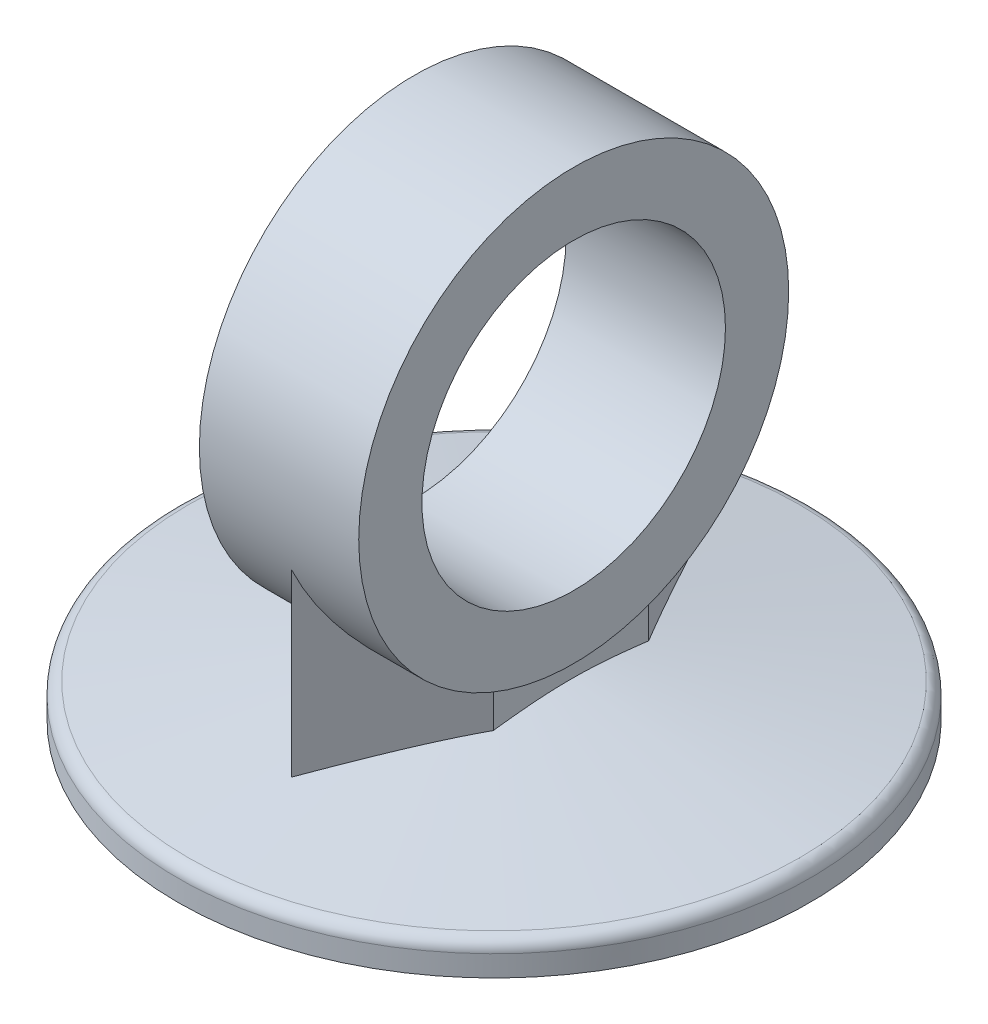
ISO-10303-21;
HEADER;
FILE_DESCRIPTION(('STEP AP214'),'2;1');
FILE_NAME('part.step','',(''),(''),'','','');
FILE_SCHEMA(('AUTOMOTIVE_DESIGN { 1 0 10303 214 1 1 1 1 }'));
ENDSEC;
DATA;
#1=APPLICATION_CONTEXT('core data for automotive mechanical design processes');
#2=APPLICATION_PROTOCOL_DEFINITION('international standard','automotive_design',2000,#1);
#3=PRODUCT_CONTEXT('',#1,'mechanical');
#4=PRODUCT('Part','Part','',(#3));
#5=PRODUCT_RELATED_PRODUCT_CATEGORY('part','',(#4));
#6=PRODUCT_DEFINITION_FORMATION('','',#4);
#7=PRODUCT_DEFINITION_CONTEXT('part definition',#1,'design');
#8=PRODUCT_DEFINITION('design','',#6,#7);
#9=PRODUCT_DEFINITION_SHAPE('','',#8);
#10=(LENGTH_UNIT() NAMED_UNIT(*) SI_UNIT(.MILLI.,.METRE.));
#11=(NAMED_UNIT(*) PLANE_ANGLE_UNIT() SI_UNIT($,.RADIAN.));
#12=(NAMED_UNIT(*) SI_UNIT($,.STERADIAN.) SOLID_ANGLE_UNIT());
#13=UNCERTAINTY_MEASURE_WITH_UNIT(LENGTH_MEASURE(1.E-05),#10,'distance_accuracy_value','');
#14=(GEOMETRIC_REPRESENTATION_CONTEXT(3) GLOBAL_UNCERTAINTY_ASSIGNED_CONTEXT((#13)) GLOBAL_UNIT_ASSIGNED_CONTEXT((#10,
#11,#12)) REPRESENTATION_CONTEXT('',''));
#15=CARTESIAN_POINT('',(0.,0.,0.));
#16=DIRECTION('',(0.,0.,1.));
#17=DIRECTION('',(1.,0.,0.));
#18=AXIS2_PLACEMENT_3D('',#15,#16,#17);
#19=CARTESIAN_POINT('',(-6.3,24.,0.));
#20=DIRECTION('',(1.,0.,0.));
#21=DIRECTION('',(0.,0.,-1.));
#22=AXIS2_PLACEMENT_3D('',#19,#20,#21);
#23=PLANE('',#22);
#24=CARTESIAN_POINT('',(-6.3,24.,0.));
#25=DIRECTION('',(1.,0.,0.));
#26=DIRECTION('',(0.,0.,-1.));
#27=AXIS2_PLACEMENT_3D('',#24,#25,#26);
#28=CIRCLE('',#27,17.);
#29=CARTESIAN_POINT('',(-6.3,24.,-17.));
#30=VERTEX_POINT('',#29);
#31=EDGE_CURVE('E119',#30,#30,#28,.T.);
#32=ORIENTED_EDGE('',*,*,#31,.F.);
#33=EDGE_LOOP('',(#32));
#34=FACE_BOUND('',#33,.T.);
#35=CARTESIAN_POINT('',(-6.3,24.,0.));
#36=DIRECTION('',(1.,0.,0.));
#37=DIRECTION('',(0.,0.,-1.));
#38=AXIS2_PLACEMENT_3D('',#35,#36,#37);
#39=CIRCLE('',#38,12.);
#40=CARTESIAN_POINT('',(-6.3,24.,-12.));
#41=VERTEX_POINT('',#40);
#42=EDGE_CURVE('E231',#41,#41,#39,.T.);
#43=ORIENTED_EDGE('',*,*,#42,.T.);
#44=EDGE_LOOP('',(#43));
#45=FACE_BOUND('',#44,.T.);
#46=ADVANCED_FACE('F41',(#34,#45),#23,.F.);
#47=CARTESIAN_POINT('',(6.3,24.,0.));
#48=DIRECTION('',(1.,0.,0.));
#49=DIRECTION('',(0.,0.,-1.));
#50=AXIS2_PLACEMENT_3D('',#47,#48,#49);
#51=PLANE('',#50);
#52=CARTESIAN_POINT('',(6.3,24.,0.));
#53=DIRECTION('',(1.,0.,0.));
#54=DIRECTION('',(0.,0.,-1.));
#55=AXIS2_PLACEMENT_3D('',#52,#53,#54);
#56=CIRCLE('',#55,17.);
#57=CARTESIAN_POINT('',(6.3,24.,-17.));
#58=VERTEX_POINT('',#57);
#59=EDGE_CURVE('E123',#58,#58,#56,.T.);
#60=ORIENTED_EDGE('',*,*,#59,.T.);
#61=EDGE_LOOP('',(#60));
#62=FACE_BOUND('',#61,.T.);
#63=CARTESIAN_POINT('',(6.3,24.,0.));
#64=DIRECTION('',(1.,0.,0.));
#65=DIRECTION('',(0.,0.,-1.));
#66=AXIS2_PLACEMENT_3D('',#63,#64,#65);
#67=CIRCLE('',#66,12.);
#68=CARTESIAN_POINT('',(6.3,24.,-12.));
#69=VERTEX_POINT('',#68);
#70=EDGE_CURVE('E228',#69,#69,#67,.T.);
#71=ORIENTED_EDGE('',*,*,#70,.F.);
#72=EDGE_LOOP('',(#71));
#73=FACE_BOUND('',#72,.T.);
#74=ADVANCED_FACE('F208',(#62,#73),#51,.T.);
#75=CARTESIAN_POINT('',(0.,2.5,0.));
#76=DIRECTION('',(0.,-1.,0.));
#77=DIRECTION('',(0.,0.,-1.));
#78=AXIS2_PLACEMENT_3D('',#75,#76,#77);
#79=CYLINDRICAL_SURFACE('',#78,25.);
#80=CARTESIAN_POINT('',(0.,1.66090036882272,0.));
#81=DIRECTION('',(0.,-1.,0.));
#82=DIRECTION('',(0.,0.,-1.));
#83=AXIS2_PLACEMENT_3D('',#80,#81,#82);
#84=CIRCLE('',#83,25.);
#85=CARTESIAN_POINT('',(0.,1.66090036882272,-25.));
#86=VERTEX_POINT('',#85);
#87=EDGE_CURVE('E143',#86,#86,#84,.T.);
#88=ORIENTED_EDGE('',*,*,#87,.T.);
#89=EDGE_LOOP('',(#88));
#90=FACE_BOUND('',#89,.T.);
#91=CARTESIAN_POINT('',(0.,0.,0.));
#92=DIRECTION('',(0.,1.,0.));
#93=DIRECTION('',(0.,0.,1.));
#94=AXIS2_PLACEMENT_3D('',#91,#92,#93);
#95=CIRCLE('',#94,25.);
#96=CARTESIAN_POINT('',(0.,0.,25.));
#97=VERTEX_POINT('',#96);
#98=EDGE_CURVE('E137',#97,#97,#95,.T.);
#99=ORIENTED_EDGE('',*,*,#98,.T.);
#100=EDGE_LOOP('',(#99));
#101=FACE_BOUND('',#100,.T.);
#102=ADVANCED_FACE('F213',(#90,#101),#79,.T.);
#103=CARTESIAN_POINT('',(0.,0.,0.));
#104=DIRECTION('',(0.,1.,0.));
#105=DIRECTION('',(0.,0.,1.));
#106=AXIS2_PLACEMENT_3D('',#103,#104,#105);
#107=PLANE('',#106);
#108=ORIENTED_EDGE('',*,*,#98,.F.);
#109=EDGE_LOOP('',(#108));
#110=FACE_BOUND('',#109,.T.);
#111=ADVANCED_FACE('F275',(#110),#107,.F.);
#112=CARTESIAN_POINT('',(0.,2.5,0.));
#113=DIRECTION('',(0.,-1.,0.));
#114=DIRECTION('',(0.,0.,1.));
#115=AXIS2_PLACEMENT_3D('',#112,#113,#114);
#116=CONICAL_SURFACE('',#115,25.,1.39626340159547);
#117=CARTESIAN_POINT('',(6.08582946409072,4.49669691295045,-12.2474601832062));
#118=CARTESIAN_POINT('',(6.08582946409072,4.54681061512929,-11.9300461263207));
#119=CARTESIAN_POINT('',(6.08582946409072,4.59656308739242,-11.6125744422735));
#120=CARTESIAN_POINT('',(6.08582946409072,4.6951513341652,-10.9774864577173));
#121=CARTESIAN_POINT('',(6.08582946409072,4.74398710188404,-10.659870156155));
#122=CARTESIAN_POINT('',(6.08582946409072,4.84054325173684,-10.0244926348981));
#123=CARTESIAN_POINT('',(6.08582946409072,4.88826371910831,-9.70673142818295));
#124=CARTESIAN_POINT('',(6.08582946409072,4.98232763522007,-9.07100526498811));
#125=CARTESIAN_POINT('',(6.08582946409072,5.0286710857419,-8.7530403087726));
#126=CARTESIAN_POINT('',(6.08582946409072,5.11953382504536,-8.1176093086983));
#127=CARTESIAN_POINT('',(6.08582946409072,5.16405713314757,-7.80014384123052));
#128=CARTESIAN_POINT('',(6.08582946409072,5.25095228709915,-7.1649189041296));
#129=CARTESIAN_POINT('',(6.08582946409072,5.29332414258174,-6.84715943581936));
#130=CARTESIAN_POINT('',(6.08582946409072,5.37535227248471,-6.21120973583331));
#131=CARTESIAN_POINT('',(6.08582946409072,5.41500788395233,-5.89301941818839));
#132=CARTESIAN_POINT('',(6.08582946409072,5.49085153917703,-5.25622193113935));
#133=CARTESIAN_POINT('',(6.08582946409072,5.52703957393163,-4.93761476065518));
#134=CARTESIAN_POINT('',(6.08582946409072,5.5951940222327,-4.29825271234782));
#135=CARTESIAN_POINT('',(6.08582946409072,5.62713727609833,-3.97749534034248));
#136=CARTESIAN_POINT('',(6.08582946409072,5.68543881860465,-3.33546676366728));
#137=CARTESIAN_POINT('',(6.08582946409072,5.71179711396621,-3.01419555961624));
#138=CARTESIAN_POINT('',(6.08582946409072,5.75765952771109,-2.37132596248471));
#139=CARTESIAN_POINT('',(6.08582946409072,5.77716726006949,-2.04972783195164));
#140=CARTESIAN_POINT('',(6.08582946409072,5.80815895977451,-1.40614146847711));
#141=CARTESIAN_POINT('',(6.08582946409072,5.81964305294414,-1.08415324173228));
#142=CARTESIAN_POINT('',(6.08582946409072,5.8337663783973,-0.439387752405406));
#143=CARTESIAN_POINT('',(6.08582946409072,5.83638937383038,-0.116610124733604));
#144=CARTESIAN_POINT('',(6.08582946409072,5.83253696084123,0.528889965099292));
#145=CARTESIAN_POINT('',(6.08582946409072,5.82606153291065,0.851612427140619));
#146=CARTESIAN_POINT('',(6.08582946409072,5.80450935188517,1.49691868200243));
#147=CARTESIAN_POINT('',(6.08582946409072,5.78942845898391,1.81950233324503));
#148=CARTESIAN_POINT('',(6.08582946409072,5.75169084724564,2.46421464327108));
#149=CARTESIAN_POINT('',(6.08582946409072,5.7290341577688,2.78634330381299));
#150=CARTESIAN_POINT('',(6.08582946409072,5.66346765004957,3.60398926382372));
#151=CARTESIAN_POINT('',(6.08582946409072,5.61622898502191,4.0991560697868));
#152=CARTESIAN_POINT('',(6.08582946409072,5.51114778017841,5.08837707263234));
#153=CARTESIAN_POINT('',(6.08582946409072,5.45330415709,5.58243115062848));
#154=CARTESIAN_POINT('',(6.08582946409072,5.33029481232116,6.56978190366947));
#155=CARTESIAN_POINT('',(6.08582946409072,5.26512667635451,7.06307827433012));
#156=CARTESIAN_POINT('',(6.08582946409072,5.12973962039283,8.04895068234565));
#157=CARTESIAN_POINT('',(6.08582946409072,5.05952089941776,8.54152674730481));
#158=CARTESIAN_POINT('',(6.08582946409072,4.91544364978416,9.52673141872408));
#159=CARTESIAN_POINT('',(6.08582946409072,4.84158096387098,10.0193594140145));
#160=CARTESIAN_POINT('',(6.08582946409072,4.69129087203342,11.0042263907093));
#161=CARTESIAN_POINT('',(6.08582946409072,4.61486344655508,11.4964653691185));
#162=CARTESIAN_POINT('',(6.08582946409072,4.46013704901975,12.4805487856354));
#163=CARTESIAN_POINT('',(6.08582946409072,4.38183844953857,12.9723932824607));
#164=CARTESIAN_POINT('',(6.08582946409072,4.2238177693227,13.955853787138));
#165=CARTESIAN_POINT('',(6.08582946409072,4.14409568678084,14.4474697946992));
#166=CARTESIAN_POINT('',(6.08582946409072,3.90389873230571,15.9184535783796));
#167=CARTESIAN_POINT('',(6.08582946409072,3.74182112901332,16.8975594231519));
#168=CARTESIAN_POINT('',(6.08582946409072,3.4150089040797,18.8553876723547));
#169=CARTESIAN_POINT('',(6.08582946409072,3.25027411978549,19.8341100495273));
#170=CARTESIAN_POINT('',(6.08582946409072,2.91944420221161,21.788934332301));
#171=CARTESIAN_POINT('',(6.08582946409072,2.75335322742824,22.7650369423733));
#172=CARTESIAN_POINT('',(6.08582946409072,2.41993394682814,24.7169648819385));
#173=CARTESIAN_POINT('',(6.08582946409072,2.25260572307166,25.6927902254414));
#174=CARTESIAN_POINT('',(6.08582946409072,2.08490186167565,26.6685502829046));
#175=B_SPLINE_CURVE_WITH_KNOTS('',3,(#117,#118,#119,#120,#121,#122,#123,#124,#125,#126,#127,
#128,#129,#130,#131,#132,#133,#134,#135,#136,#137,#138,#139,#140,#141,#142,#143,#144,#145,#146,
#147,#148,#149,#150,#151,#152,#153,#154,#155,#156,#157,#158,#159,#160,#161,#162,#163,#164,#165,
#166,#167,#168,#169,#170,#171,#172,#173,#174),.UNSPECIFIED.,.F.,.F.,(4,2,2,2,2,2,2,2,2,2,2,2,2,
2,2,2,2,2,2,2,2,2,2,2,2,2,2,2,4),(0.,0.964037809000425,1.92808275662936,2.89205378400872,
3.85602356418257,4.81773493178247,5.77944199289758,6.741382947257,7.7033263989265,
8.67031978964613,9.63731201669252,10.6037933434998,11.5702595140544,12.5384956549066,
13.5067338718021,14.4754382694417,15.4441389128889,16.9362022248111,18.4284180326423,
19.9211271511466,21.4137774811502,22.9081719797097,24.4025778743436,25.8966886519187,
27.3908013264567,30.3680844641506,33.3455505459734,36.3159472853225,39.2861487500719),.UNSPECIFIED.);
#176=CARTESIAN_POINT('',(6.08582946409072,5.38341969827996,6.14318517619276));
#177=VERTEX_POINT('',#176);
#178=CARTESIAN_POINT('',(6.08582946409072,5.38341969827996,-6.14318517619276));
#179=VERTEX_POINT('',#178);
#180=EDGE_CURVE('E190',#177,#179,#175,.F.);
#181=ORIENTED_EDGE('',*,*,#180,.F.);
#182=CARTESIAN_POINT('',(10.5086456746742,5.04634108931012,-1.02979052035163));
#183=CARTESIAN_POINT('',(10.2754542320653,5.09373787676991,-0.651597877737804));
#184=CARTESIAN_POINT('',(10.0420761168008,5.13810044928308,-0.273102487200898));
#185=CARTESIAN_POINT('',(9.57489744546846,5.21904589225505,0.4845734133694));
#186=CARTESIAN_POINT('',(9.34109680511881,5.25562698423437,0.863754060092081));
#187=CARTESIAN_POINT('',(8.87330860891856,5.31925075144018,1.62241849530994));
#188=CARTESIAN_POINT('',(8.63932133088789,5.34630066733287,2.00190183323347));
#189=CARTESIAN_POINT('',(8.17107792898637,5.38922867489642,2.76130452644729));
#190=CARTESIAN_POINT('',(7.93682182876661,5.40510768365314,3.14122384337995));
#191=CARTESIAN_POINT('',(7.46910450685292,5.42449857464364,3.89977333384071));
#192=CARTESIAN_POINT('',(7.23564386339194,5.42805978055193,4.27840256958376));
#193=CARTESIAN_POINT('',(6.76875866021348,5.4226708234991,5.03560252002743));
#194=CARTESIAN_POINT('',(6.53533410134418,5.41372040121755,5.41417323335244));
#195=CARTESIAN_POINT('',(6.06869678287895,5.38399948057822,6.17097116143323));
#196=CARTESIAN_POINT('',(5.83548402375237,5.3632289560907,6.5491983754278));
#197=CARTESIAN_POINT('',(5.36938318146673,5.31127529153388,7.30512624008865));
#198=CARTESIAN_POINT('',(5.13649510177577,5.28009204108279,7.68282688513031));
#199=CARTESIAN_POINT('',(4.51426376032776,5.18511970923913,8.69196904192047));
#200=CARTESIAN_POINT('',(4.12525192976366,5.11351930735127,9.32287303463611));
#201=CARTESIAN_POINT('',(3.34817488070752,4.95364501038471,10.583145793401));
#202=CARTESIAN_POINT('',(2.96010974916479,4.86536963817432,11.2125144184348));
#203=CARTESIAN_POINT('',(2.18447032881893,4.6776420914881,12.4704556139358));
#204=CARTESIAN_POINT('',(1.79689654157903,4.578182484643,13.0990273709618));
#205=CARTESIAN_POINT('',(1.02232022758336,4.37178139334505,14.3552444079969));
#206=CARTESIAN_POINT('',(0.635317678050826,4.26484021590781,14.9828897249456));
#207=CARTESIAN_POINT('',(-0.141631129621332,4.04486190659904,16.2429545003155));
#208=CARTESIAN_POINT('',(-0.531573879996266,3.93178003009919,16.8753682698025));
#209=CARTESIAN_POINT('',(-1.31116309867273,3.70192106708193,18.1397152950017));
#210=CARTESIAN_POINT('',(-1.70080956322334,3.58514393455538,18.7716485446307));
#211=CARTESIAN_POINT('',(-2.47928284534828,3.34910646530381,20.034185730718));
#212=CARTESIAN_POINT('',(-2.86811000434147,3.22985020518453,20.6647902208934));
#213=CARTESIAN_POINT('',(-3.64558362855302,2.98932530690547,21.9257061499408));
#214=CARTESIAN_POINT('',(-4.03423009779539,2.86805671600857,22.556017595339));
#215=CARTESIAN_POINT('',(-4.42281621058353,2.74610091209791,23.186231153925));
#216=B_SPLINE_CURVE_WITH_KNOTS('',3,(#182,#183,#184,#185,#186,#187,#188,#189,#190,#191,#192,
#193,#194,#195,#196,#197,#198,#199,#200,#201,#202,#203,#204,#205,#206,#207,#208,#209,#210,#211,
#212,#213,#214,#215),.UNSPECIFIED.,.F.,.F.,(4,2,2,2,2,2,2,2,2,2,2,2,2,2,2,2,4),(0.,
1.34051866893575,2.68134338881338,4.02114730049537,5.36084120690819,6.69516438191497,
8.02951521298607,9.36386899381002,10.6982369201188,12.9318566157413,15.1656742666781,
17.4009852502739,19.6362045588292,21.8907670587465,24.1453576409799,26.39649557278,
28.6475807075625),.UNSPECIFIED.);
#217=CARTESIAN_POINT('',(0.,4.08460553159832,16.0132554573806));
#218=VERTEX_POINT('',#217);
#219=EDGE_CURVE('E49',#177,#218,#216,.T.);
#220=ORIENTED_EDGE('',*,*,#219,.T.);
#221=CARTESIAN_POINT('',(4.42281621058353,2.74610091209791,23.186231153925));
#222=CARTESIAN_POINT('',(4.17935902777457,2.82252930153773,22.7913894123082));
#223=CARTESIAN_POINT('',(3.93587666380248,2.8986670973349,22.3965068315829));
#224=CARTESIAN_POINT('',(3.44885083744081,3.0502349366748,21.6066425799954));
#225=CARTESIAN_POINT('',(3.20530737494385,3.12566497896449,21.211660908959));
#226=CARTESIAN_POINT('',(2.47455024042898,3.35070947069641,20.0265103360258));
#227=CARTESIAN_POINT('',(1.98723009755741,3.49907189806572,19.2361687584378));
#228=CARTESIAN_POINT('',(1.00918208693798,3.79183300533765,17.6499589147099));
#229=CARTESIAN_POINT('',(0.518451723101734,3.93620163028629,16.8540866003843));
#230=CARTESIAN_POINT('',(-0.218093072249589,4.14703857922358,15.6595495305805));
#231=CARTESIAN_POINT('',(-0.463681891397356,4.21636463041586,15.2612506759108));
#232=CARTESIAN_POINT('',(-0.955045317181261,4.35259234541835,14.4643516542231));
#233=CARTESIAN_POINT('',(-1.20081992386045,4.41949400866656,14.0657514871352));
#234=CARTESIAN_POINT('',(-1.68892181983125,4.54924063149852,13.2741420531149));
#235=CARTESIAN_POINT('',(-1.93124575237282,4.61213126654351,12.8811382301995));
#236=CARTESIAN_POINT('',(-2.4161605838488,4.73408599792028,12.0946976151118));
#237=CARTESIAN_POINT('',(-2.65875148328579,4.79315008703571,11.7012608221244));
#238=CARTESIAN_POINT('',(-3.14428272811948,4.90636189622083,10.9138205005549));
#239=CARTESIAN_POINT('',(-3.38722311404575,4.96050898988517,10.5198169062413));
#240=CARTESIAN_POINT('',(-3.87347394843506,5.06246596997392,9.73120954581046));
#241=CARTESIAN_POINT('',(-4.11678439721914,5.11027585089776,9.33660577917254));
#242=CARTESIAN_POINT('',(-4.60313626714421,5.19769696940701,8.54783455811356));
#243=CARTESIAN_POINT('',(-4.84617656624434,5.23733055297261,8.15366892343165));
#244=CARTESIAN_POINT('',(-5.33265714717188,5.30660592256357,7.36468895734493));
#245=CARTESIAN_POINT('',(-5.57609742946582,5.33624769692617,6.96987462518348));
#246=CARTESIAN_POINT('',(-6.06321867789902,5.38362140471616,6.17985561695055));
#247=CARTESIAN_POINT('',(-6.30689953029508,5.40135749376807,5.78465112534914));
#248=CARTESIAN_POINT('',(-6.79442044914682,5.42354021879246,4.99398392689933));
#249=CARTESIAN_POINT('',(-7.03826050466215,5.42798768791884,4.5985212377941));
#250=CARTESIAN_POINT('',(-7.4165603043117,5.42430647956045,3.98499014364633));
#251=CARTESIAN_POINT('',(-7.55103746160826,5.4209228533949,3.76689349773092));
#252=CARTESIAN_POINT('',(-7.81994941511697,5.41011068032456,3.33076890760833));
#253=CARTESIAN_POINT('',(-7.95438421073144,5.40268207869947,3.11274096437049));
#254=CARTESIAN_POINT('',(-8.22325737367612,5.38395340516017,2.67667928524394));
#255=CARTESIAN_POINT('',(-8.35769569730236,5.37265107635056,2.45864562023484));
#256=CARTESIAN_POINT('',(-8.62647301334899,5.34643637694051,2.02273938674235));
#257=CARTESIAN_POINT('',(-8.76081200653314,5.33152403439289,1.80486681702032));
#258=CARTESIAN_POINT('',(-9.16460262851442,5.28171415178771,1.14999440540316));
#259=CARTESIAN_POINT('',(-9.43388685864757,5.24181332686877,0.713266052643312));
#260=CARTESIAN_POINT('',(-9.83732836470817,5.17399827668871,0.0589598413598559));
#261=CARTESIAN_POINT('',(-9.97167857780684,5.15007625148459,-0.158930924952409));
#262=CARTESIAN_POINT('',(-10.2402531645302,5.09988859212455,-0.59450836962807));
#263=CARTESIAN_POINT('',(-10.3744775429997,5.07362305228629,-0.812195055848924));
#264=CARTESIAN_POINT('',(-10.5086456746742,5.04634108931012,-1.02979052035163));
#265=B_SPLINE_CURVE_WITH_KNOTS('',3,(#221,#222,#223,#224,#225,#226,#227,#228,#229,#230,#231,
#232,#233,#234,#235,#236,#237,#238,#239,#240,#241,#242,#243,#244,#245,#246,#247,#248,#249,#250,
#251,#252,#253,#254,#255,#256,#257,#258,#259,#260,#261,#262,#263,#264),.UNSPECIFIED.,.F.,.F.,(4,
2,2,2,2,2,2,2,2,2,2,2,2,2,2,2,2,2,2,2,2,4),(0.,1.41035963255173,2.82072176160264,
5.64156349051909,8.47978577758233,9.89888551853934,11.3179855884603,12.7158836132623,
14.1137842742342,15.5118627729894,16.9099424852392,18.3041490622919,19.6983572667033,
21.09207857578,22.4857125011623,23.2544204118314,24.0231387218167,24.7923056628593,
25.5614666270226,27.1051698485575,27.8764525027119,28.6477041296279),.UNSPECIFIED.);
#266=CARTESIAN_POINT('',(-6.08582946409072,5.38341969827996,6.14318517619276));
#267=VERTEX_POINT('',#266);
#268=EDGE_CURVE('E99',#218,#267,#265,.T.);
#269=ORIENTED_EDGE('',*,*,#268,.T.);
#270=CARTESIAN_POINT('',(-6.08582946409072,4.49669691295045,-12.2474601832062));
#271=CARTESIAN_POINT('',(-6.08582946409072,4.54681061512929,-11.9300461263207));
#272=CARTESIAN_POINT('',(-6.08582946409072,4.59656308739242,-11.6125744422735));
#273=CARTESIAN_POINT('',(-6.08582946409072,4.6951513341652,-10.9774864577173));
#274=CARTESIAN_POINT('',(-6.08582946409072,4.74398710188404,-10.659870156155));
#275=CARTESIAN_POINT('',(-6.08582946409072,4.84054325173684,-10.0244926348981));
#276=CARTESIAN_POINT('',(-6.08582946409072,4.88826371910831,-9.70673142818295));
#277=CARTESIAN_POINT('',(-6.08582946409072,4.98232763522007,-9.07100526498811));
#278=CARTESIAN_POINT('',(-6.08582946409072,5.0286710857419,-8.7530403087726));
#279=CARTESIAN_POINT('',(-6.08582946409072,5.11953382504536,-8.11760930869831));
#280=CARTESIAN_POINT('',(-6.08582946409072,5.16405713314757,-7.80014384123052));
#281=CARTESIAN_POINT('',(-6.08582946409072,5.25095228709915,-7.1649189041296));
#282=CARTESIAN_POINT('',(-6.08582946409072,5.29332414258173,-6.84715943581936));
#283=CARTESIAN_POINT('',(-6.08582946409072,5.37535227248471,-6.21120973583332));
#284=CARTESIAN_POINT('',(-6.08582946409072,5.41500788395233,-5.8930194181884));
#285=CARTESIAN_POINT('',(-6.08582946409072,5.49085153917703,-5.25622193113936));
#286=CARTESIAN_POINT('',(-6.08582946409072,5.52703957393163,-4.93761476065519));
#287=CARTESIAN_POINT('',(-6.08582946409072,5.5951940222327,-4.29825271234782));
#288=CARTESIAN_POINT('',(-6.08582946409072,5.62713727609833,-3.97749534034248));
#289=CARTESIAN_POINT('',(-6.08582946409072,5.68543881860465,-3.33546676366728));
#290=CARTESIAN_POINT('',(-6.08582946409072,5.71179711396621,-3.01419555961624));
#291=CARTESIAN_POINT('',(-6.08582946409072,5.75765952771109,-2.37132596248471));
#292=CARTESIAN_POINT('',(-6.08582946409072,5.77716726006949,-2.04972783195164));
#293=CARTESIAN_POINT('',(-6.08582946409072,5.80815895977451,-1.40614146847711));
#294=CARTESIAN_POINT('',(-6.08582946409072,5.81964305294414,-1.08415324173228));
#295=CARTESIAN_POINT('',(-6.08582946409072,5.8337663783973,-0.439387752405406));
#296=CARTESIAN_POINT('',(-6.08582946409072,5.83638937383038,-0.116610124733602));
#297=CARTESIAN_POINT('',(-6.08582946409072,5.83253696084123,0.528889965099294));
#298=CARTESIAN_POINT('',(-6.08582946409072,5.82606153291065,0.851612427140621));
#299=CARTESIAN_POINT('',(-6.08582946409072,5.80450935188517,1.49691868200243));
#300=CARTESIAN_POINT('',(-6.08582946409072,5.78942845898391,1.81950233324504));
#301=CARTESIAN_POINT('',(-6.08582946409072,5.75169084724564,2.46421464327108));
#302=CARTESIAN_POINT('',(-6.08582946409072,5.7290341577688,2.786343303813));
#303=CARTESIAN_POINT('',(-6.08582946409072,5.66346765004957,3.60398926382373));
#304=CARTESIAN_POINT('',(-6.08582946409072,5.61622898502191,4.09915606978681));
#305=CARTESIAN_POINT('',(-6.08582946409072,5.51114778017841,5.08837707263235));
#306=CARTESIAN_POINT('',(-6.08582946409072,5.45330415709,5.58243115062849));
#307=CARTESIAN_POINT('',(-6.08582946409072,5.33029481232116,6.56978190366948));
#308=CARTESIAN_POINT('',(-6.08582946409072,5.26512667635451,7.06307827433013));
#309=CARTESIAN_POINT('',(-6.08582946409072,5.12973962039283,8.04895068234565));
#310=CARTESIAN_POINT('',(-6.08582946409072,5.05952089941776,8.54152674730482));
#311=CARTESIAN_POINT('',(-6.08582946409072,4.91544364978415,9.52673141872409));
#312=CARTESIAN_POINT('',(-6.08582946409072,4.84158096387097,10.0193594140145));
#313=CARTESIAN_POINT('',(-6.08582946409072,4.69129087203341,11.0042263907093));
#314=CARTESIAN_POINT('',(-6.08582946409072,4.61486344655508,11.4964653691185));
#315=CARTESIAN_POINT('',(-6.08582946409072,4.46013704901974,12.4805487856354));
#316=CARTESIAN_POINT('',(-6.08582946409072,4.38183844953857,12.9723932824607));
#317=CARTESIAN_POINT('',(-6.08582946409072,4.2238177693227,13.955853787138));
#318=CARTESIAN_POINT('',(-6.08582946409072,4.14409568678084,14.4474697946992));
#319=CARTESIAN_POINT('',(-6.08582946409072,3.9038987323057,15.9184535783796));
#320=CARTESIAN_POINT('',(-6.08582946409072,3.74182112901332,16.8975594231519));
#321=CARTESIAN_POINT('',(-6.08582946409072,3.41500890407969,18.8553876723547));
#322=CARTESIAN_POINT('',(-6.08582946409072,3.25027411978549,19.8341100495273));
#323=CARTESIAN_POINT('',(-6.08582946409072,2.9194442022116,21.7889343323011));
#324=CARTESIAN_POINT('',(-6.08582946409072,2.75335322742824,22.7650369423733));
#325=CARTESIAN_POINT('',(-6.08582946409072,2.41993394682814,24.7169648819385));
#326=CARTESIAN_POINT('',(-6.08582946409072,2.25260572307165,25.6927902254415));
#327=CARTESIAN_POINT('',(-6.08582946409072,2.08490186167565,26.6685502829046));
#328=B_SPLINE_CURVE_WITH_KNOTS('',3,(#270,#271,#272,#273,#274,#275,#276,#277,#278,#279,#280,
#281,#282,#283,#284,#285,#286,#287,#288,#289,#290,#291,#292,#293,#294,#295,#296,#297,#298,#299,
#300,#301,#302,#303,#304,#305,#306,#307,#308,#309,#310,#311,#312,#313,#314,#315,#316,#317,#318,
#319,#320,#321,#322,#323,#324,#325,#326,#327),.UNSPECIFIED.,.F.,.F.,(4,2,2,2,2,2,2,2,2,2,2,2,2,
2,2,2,2,2,2,2,2,2,2,2,2,2,2,2,4),(0.,0.964037809000425,1.92808275662936,2.89205378400872,
3.85602356418258,4.81773493178248,5.77944199289759,6.74138294725701,7.70332639892651,
8.67031978964614,9.63731201669252,10.6037933434998,11.5702595140544,12.5384956549066,
13.5067338718022,14.4754382694417,15.4441389128889,16.9362022248112,18.4284180326423,
19.9211271511466,21.4137774811502,22.9081719797097,24.4025778743436,25.8966886519188,
27.3908013264567,30.3680844641506,33.3455505459734,36.3159472853225,39.2861487500719),.UNSPECIFIED.);
#329=CARTESIAN_POINT('',(-6.08582946409072,5.38341969827996,-6.14318517619276));
#330=VERTEX_POINT('',#329);
#331=EDGE_CURVE('E152',#267,#330,#328,.F.);
#332=ORIENTED_EDGE('',*,*,#331,.T.);
#333=CARTESIAN_POINT('',(4.42281621058353,2.74610091209791,-23.186231153925));
#334=CARTESIAN_POINT('',(4.17935902777457,2.82252930153773,-22.7913894123082));
#335=CARTESIAN_POINT('',(3.93587666380248,2.8986670973349,-22.3965068315829));
#336=CARTESIAN_POINT('',(3.44885083744081,3.0502349366748,-21.6066425799954));
#337=CARTESIAN_POINT('',(3.20530737494385,3.12566497896449,-21.211660908959));
#338=CARTESIAN_POINT('',(2.47455024042898,3.35070947069641,-20.0265103360258));
#339=CARTESIAN_POINT('',(1.98723009755741,3.49907189806572,-19.2361687584378));
#340=CARTESIAN_POINT('',(1.00918208693798,3.79183300533765,-17.6499589147099));
#341=CARTESIAN_POINT('',(0.518451723101732,3.93620163028629,-16.8540866003843));
#342=CARTESIAN_POINT('',(-0.218093072249593,4.14703857922358,-15.6595495305805));
#343=CARTESIAN_POINT('',(-0.463681891397359,4.21636463041586,-15.2612506759108));
#344=CARTESIAN_POINT('',(-0.955045317181264,4.35259234541835,-14.4643516542231));
#345=CARTESIAN_POINT('',(-1.20081992386046,4.41949400866656,-14.0657514871352));
#346=CARTESIAN_POINT('',(-1.68892181983125,4.54924063149851,-13.2741420531149));
#347=CARTESIAN_POINT('',(-1.93124575237283,4.61213126654351,-12.8811382301995));
#348=CARTESIAN_POINT('',(-2.4161605838488,4.73408599792028,-12.0946976151118));
#349=CARTESIAN_POINT('',(-2.65875148328579,4.79315008703571,-11.7012608221244));
#350=CARTESIAN_POINT('',(-3.14428272811949,4.90636189622083,-10.9138205005549));
#351=CARTESIAN_POINT('',(-3.38722311404575,4.96050898988517,-10.5198169062413));
#352=CARTESIAN_POINT('',(-3.87347394843507,5.06246596997392,-9.73120954581046));
#353=CARTESIAN_POINT('',(-4.11678439721915,5.11027585089776,-9.33660577917254));
#354=CARTESIAN_POINT('',(-4.60313626714422,5.19769696940701,-8.54783455811356));
#355=CARTESIAN_POINT('',(-4.84617656624435,5.2373305529726,-8.15366892343164));
#356=CARTESIAN_POINT('',(-5.33265714717188,5.30660592256357,-7.36468895734492));
#357=CARTESIAN_POINT('',(-5.57609742946582,5.33624769692617,-6.96987462518348));
#358=CARTESIAN_POINT('',(-6.06321867789903,5.38362140471616,-6.17985561695055));
#359=CARTESIAN_POINT('',(-6.30689953029508,5.40135749376807,-5.78465112534914));
#360=CARTESIAN_POINT('',(-6.79442044914682,5.42354021879246,-4.99398392689932));
#361=CARTESIAN_POINT('',(-7.03826050466216,5.42798768791884,-4.59852123779409));
#362=CARTESIAN_POINT('',(-7.41656030431171,5.42430647956045,-3.98499014364632));
#363=CARTESIAN_POINT('',(-7.55103746160826,5.4209228533949,-3.76689349773091));
#364=CARTESIAN_POINT('',(-7.81994941511697,5.41011068032456,-3.33076890760833));
#365=CARTESIAN_POINT('',(-7.95438421073145,5.40268207869946,-3.11274096437048));
#366=CARTESIAN_POINT('',(-8.22325737367612,5.38395340516016,-2.67667928524394));
#367=CARTESIAN_POINT('',(-8.35769569730236,5.37265107635056,-2.45864562023484));
#368=CARTESIAN_POINT('',(-8.626473013349,5.34643637694051,-2.02273938674235));
#369=CARTESIAN_POINT('',(-8.76081200653314,5.33152403439289,-1.80486681702032));
#370=CARTESIAN_POINT('',(-9.16460262851443,5.28171415178771,-1.14999440540316));
#371=CARTESIAN_POINT('',(-9.43388685864757,5.24181332686877,-0.713266052643308));
#372=CARTESIAN_POINT('',(-9.83732836470817,5.17399827668871,-0.0589598413598507));
#373=CARTESIAN_POINT('',(-9.97167857780685,5.15007625148459,0.158930924952415));
#374=CARTESIAN_POINT('',(-10.2402531645302,5.09988859212455,0.594508369628076));
#375=CARTESIAN_POINT('',(-10.3744775429997,5.07362305228629,0.812195055848929));
#376=CARTESIAN_POINT('',(-10.5086456746743,5.04634108931012,1.02979052035164));
#377=B_SPLINE_CURVE_WITH_KNOTS('',3,(#333,#334,#335,#336,#337,#338,#339,#340,#341,#342,#343,
#344,#345,#346,#347,#348,#349,#350,#351,#352,#353,#354,#355,#356,#357,#358,#359,#360,#361,#362,
#363,#364,#365,#366,#367,#368,#369,#370,#371,#372,#373,#374,#375,#376),.UNSPECIFIED.,.F.,.F.,(4,
2,2,2,2,2,2,2,2,2,2,2,2,2,2,2,2,2,2,2,2,4),(0.,1.41035963255173,2.82072176160264,
5.6415634905191,8.47978577758233,9.89888551853935,11.3179855884603,12.7158836132623,
14.1137842742342,15.5118627729894,16.9099424852392,18.3041490622919,19.6983572667033,
21.09207857578,22.4857125011623,23.2544204118314,24.0231387218167,24.7923056628593,
25.5614666270226,27.1051698485575,27.8764525027119,28.6477041296279),.UNSPECIFIED.);
#378=CARTESIAN_POINT('',(0.,4.08460553159832,-16.0132554573806));
#379=VERTEX_POINT('',#378);
#380=EDGE_CURVE('E178',#379,#330,#377,.T.);
#381=ORIENTED_EDGE('',*,*,#380,.F.);
#382=CARTESIAN_POINT('',(10.5086456746743,5.04634108931012,1.02979052035164));
#383=CARTESIAN_POINT('',(10.2754542320653,5.09373787676991,0.651597877737808));
#384=CARTESIAN_POINT('',(10.0420761168008,5.13810044928308,0.273102487200902));
#385=CARTESIAN_POINT('',(9.57489744546847,5.21904589225504,-0.484573413369396));
#386=CARTESIAN_POINT('',(9.34109680511881,5.25562698423437,-0.863754060092077));
#387=CARTESIAN_POINT('',(8.87330860891856,5.31925075144018,-1.62241849530993));
#388=CARTESIAN_POINT('',(8.6393213308879,5.34630066733287,-2.00190183323346));
#389=CARTESIAN_POINT('',(8.17107792898637,5.38922867489642,-2.76130452644729));
#390=CARTESIAN_POINT('',(7.93682182876661,5.40510768365314,-3.14122384337994));
#391=CARTESIAN_POINT('',(7.46910450685292,5.42449857464364,-3.89977333384071));
#392=CARTESIAN_POINT('',(7.23564386339195,5.42805978055193,-4.27840256958376));
#393=CARTESIAN_POINT('',(6.76875866021348,5.4226708234991,-5.03560252002743));
#394=CARTESIAN_POINT('',(6.53533410134419,5.41372040121755,-5.41417323335244));
#395=CARTESIAN_POINT('',(6.06869678287896,5.38399948057822,-6.17097116143323));
#396=CARTESIAN_POINT('',(5.83548402375237,5.3632289560907,-6.5491983754278));
#397=CARTESIAN_POINT('',(5.36938318146673,5.31127529153388,-7.30512624008864));
#398=CARTESIAN_POINT('',(5.13649510177578,5.28009204108279,-7.68282688513031));
#399=CARTESIAN_POINT('',(4.51426376032777,5.18511970923913,-8.69196904192048));
#400=CARTESIAN_POINT('',(4.12525192976366,5.11351930735127,-9.32287303463611));
#401=CARTESIAN_POINT('',(3.34817488070752,4.95364501038471,-10.583145793401));
#402=CARTESIAN_POINT('',(2.96010974916479,4.86536963817432,-11.2125144184348));
#403=CARTESIAN_POINT('',(2.18447032881893,4.6776420914881,-12.4704556139358));
#404=CARTESIAN_POINT('',(1.79689654157903,4.578182484643,-13.0990273709618));
#405=CARTESIAN_POINT('',(1.02232022758336,4.37178139334505,-14.3552444079969));
#406=CARTESIAN_POINT('',(0.635317678050827,4.26484021590781,-14.9828897249456));
#407=CARTESIAN_POINT('',(-0.141631129621331,4.04486190659903,-16.2429545003155));
#408=CARTESIAN_POINT('',(-0.531573879996266,3.93178003009919,-16.8753682698025));
#409=CARTESIAN_POINT('',(-1.31116309867273,3.70192106708193,-18.1397152950017));
#410=CARTESIAN_POINT('',(-1.70080956322334,3.58514393455538,-18.7716485446307));
#411=CARTESIAN_POINT('',(-2.47928284534828,3.34910646530381,-20.034185730718));
#412=CARTESIAN_POINT('',(-2.86811000434147,3.22985020518453,-20.6647902208934));
#413=CARTESIAN_POINT('',(-3.64558362855302,2.98932530690547,-21.9257061499408));
#414=CARTESIAN_POINT('',(-4.0342300977954,2.86805671600857,-22.556017595339));
#415=CARTESIAN_POINT('',(-4.42281621058353,2.74610091209791,-23.186231153925));
#416=B_SPLINE_CURVE_WITH_KNOTS('',3,(#382,#383,#384,#385,#386,#387,#388,#389,#390,#391,#392,
#393,#394,#395,#396,#397,#398,#399,#400,#401,#402,#403,#404,#405,#406,#407,#408,#409,#410,#411,
#412,#413,#414,#415),.UNSPECIFIED.,.F.,.F.,(4,2,2,2,2,2,2,2,2,2,2,2,2,2,2,2,4),(0.,
1.34051866893576,2.68134338881338,4.02114730049537,5.3608412069082,6.69516438191498,
8.02951521298607,9.36386899381002,10.6982369201188,12.9318566157413,15.1656742666781,
17.4009852502739,19.6362045588292,21.8907670587465,24.1453576409799,26.3964955727801,
28.6475807075625),.UNSPECIFIED.);
#417=EDGE_CURVE('E184',#179,#379,#416,.T.);
#418=ORIENTED_EDGE('',*,*,#417,.F.);
#419=EDGE_LOOP('',(#181,#220,#269,#332,#381,#418));
#420=FACE_BOUND('',#419,.T.);
#421=CARTESIAN_POINT('',(0.,2.64570812183493,0.));
#422=DIRECTION('',(0.,1.,0.));
#423=DIRECTION('',(0.,0.,1.));
#424=AXIS2_PLACEMENT_3D('',#421,#422,#423);
#425=CIRCLE('',#424,24.1736481776669);
#426=CARTESIAN_POINT('',(0.,2.64570812183493,24.1736481776669));
#427=VERTEX_POINT('',#426);
#428=EDGE_CURVE('E140',#427,#427,#425,.T.);
#429=ORIENTED_EDGE('',*,*,#428,.T.);
#430=EDGE_LOOP('',(#429));
#431=FACE_BOUND('',#430,.T.);
#432=ADVANCED_FACE('F158',(#420,#431),#116,.T.);
#433=CARTESIAN_POINT('',(0.,1.66090036882272,0.));
#434=DIRECTION('',(0.,-1.,0.));
#435=DIRECTION('',(0.,0.,-1.));
#436=AXIS2_PLACEMENT_3D('',#433,#434,#435);
#437=TOROIDAL_SURFACE('',#436,24.,1.);
#438=ORIENTED_EDGE('',*,*,#87,.F.);
#439=EDGE_LOOP('',(#438));
#440=FACE_BOUND('',#439,.T.);
#441=ORIENTED_EDGE('',*,*,#428,.F.);
#442=EDGE_LOOP('',(#441));
#443=FACE_BOUND('',#442,.T.);
#444=ADVANCED_FACE('F43',(#440,#443),#437,.T.);
#445=CARTESIAN_POINT('',(-0.22590168765383,19.,16.3796254890975));
#446=DIRECTION('',(0.851198373912215,0.,0.52484409899436));
#447=DIRECTION('',(0.52484409899436,0.,-0.851198373912215));
#448=AXIS2_PLACEMENT_3D('',#445,#446,#447);
#449=PLANE('',#448);
#450=CARTESIAN_POINT('',(9.87368266913797,24.,0.));
#451=DIRECTION('',(0.851198373912215,0.,0.52484409899436));
#452=DIRECTION('',(0.52484409899436,0.,-0.851198373912215));
#453=AXIS2_PLACEMENT_3D('',#450,#451,#452);
#454=ELLIPSE('',#453,19.9718426644377,17.);
#455=CARTESIAN_POINT('',(0.,18.2924918172052,16.0132554573806));
#456=VERTEX_POINT('',#455);
#457=CARTESIAN_POINT('',(6.08582946409072,8.14877683296946,6.14318517619276));
#458=VERTEX_POINT('',#457);
#459=EDGE_CURVE('E104',#456,#458,#454,.T.);
#460=ORIENTED_EDGE('',*,*,#459,.F.);
#461=DIRECTION('',(0.,-1.,0.));
#462=VECTOR('',#461,1.);
#463=CARTESIAN_POINT('',(0.,19.,16.0132554573806));
#464=LINE('',#463,#462);
#465=EDGE_CURVE('E94',#456,#218,#464,.T.);
#466=ORIENTED_EDGE('',*,*,#465,.T.);
#467=ORIENTED_EDGE('',*,*,#219,.F.);
#468=DIRECTION('',(0.,-1.,0.));
#469=VECTOR('',#468,1.);
#470=CARTESIAN_POINT('',(6.08582946409072,19.,6.14318517619276));
#471=LINE('',#470,#469);
#472=EDGE_CURVE('E108',#458,#177,#471,.T.);
#473=ORIENTED_EDGE('',*,*,#472,.F.);
#474=EDGE_LOOP('',(#460,#466,#467,#473));
#475=FACE_BOUND('',#474,.T.);
#476=ADVANCED_FACE('F107',(#475),#449,.T.);
#477=CARTESIAN_POINT('',(6.08582946409072,19.,0.));
#478=DIRECTION('',(-1.,0.,0.));
#479=DIRECTION('',(0.,0.,1.));
#480=AXIS2_PLACEMENT_3D('',#477,#478,#479);
#481=PLANE('',#480);
#482=DIRECTION('',(0.,-1.,0.));
#483=VECTOR('',#482,1.);
#484=CARTESIAN_POINT('',(6.08582946409072,19.,-6.14318517619276));
#485=LINE('',#484,#483);
#486=CARTESIAN_POINT('',(6.08582946409072,8.14877683296946,-6.14318517619276));
#487=VERTEX_POINT('',#486);
#488=EDGE_CURVE('E134',#487,#179,#485,.T.);
#489=ORIENTED_EDGE('',*,*,#488,.F.);
#490=CARTESIAN_POINT('',(6.08582946409072,24.,0.));
#491=DIRECTION('',(-1.,0.,0.));
#492=DIRECTION('',(0.,0.,1.));
#493=AXIS2_PLACEMENT_3D('',#490,#491,#492);
#494=CIRCLE('',#493,17.);
#495=EDGE_CURVE('E56',#487,#458,#494,.T.);
#496=ORIENTED_EDGE('',*,*,#495,.T.);
#497=ORIENTED_EDGE('',*,*,#472,.T.);
#498=ORIENTED_EDGE('',*,*,#180,.T.);
#499=EDGE_LOOP('',(#489,#496,#497,#498));
#500=FACE_BOUND('',#499,.T.);
#501=ADVANCED_FACE('F198',(#500),#481,.F.);
#502=CARTESIAN_POINT('',(-0.225901687653823,19.,-16.3796254890975));
#503=DIRECTION('',(-0.851198373912215,0.,0.52484409899436));
#504=DIRECTION('',(0.52484409899436,0.,0.851198373912215));
#505=AXIS2_PLACEMENT_3D('',#502,#503,#504);
#506=PLANE('',#505);
#507=DIRECTION('',(0.,-1.,0.));
#508=VECTOR('',#507,1.);
#509=CARTESIAN_POINT('',(0.,19.,-16.0132554573806));
#510=LINE('',#509,#508);
#511=CARTESIAN_POINT('',(0.,18.2924918172052,-16.0132554573806));
#512=VERTEX_POINT('',#511);
#513=EDGE_CURVE('E132',#512,#379,#510,.T.);
#514=ORIENTED_EDGE('',*,*,#513,.F.);
#515=CARTESIAN_POINT('',(9.87368266913798,24.,0.));
#516=DIRECTION('',(-0.851198373912215,0.,0.52484409899436));
#517=DIRECTION('',(0.52484409899436,0.,0.851198373912215));
#518=AXIS2_PLACEMENT_3D('',#515,#516,#517);
#519=ELLIPSE('',#518,19.9718426644377,17.);
#520=EDGE_CURVE('E64',#512,#487,#519,.T.);
#521=ORIENTED_EDGE('',*,*,#520,.T.);
#522=ORIENTED_EDGE('',*,*,#488,.T.);
#523=ORIENTED_EDGE('',*,*,#417,.T.);
#524=EDGE_LOOP('',(#514,#521,#522,#523));
#525=FACE_BOUND('',#524,.T.);
#526=ADVANCED_FACE('F174',(#525),#506,.F.);
#527=CARTESIAN_POINT('',(-14.533631540426,19.,7.55756025332978));
#528=DIRECTION('',(0.851198373912215,0.,0.52484409899436));
#529=DIRECTION('',(0.52484409899436,0.,-0.851198373912215));
#530=AXIS2_PLACEMENT_3D('',#527,#528,#529);
#531=PLANE('',#530);
#532=DIRECTION('',(0.,-1.,0.));
#533=VECTOR('',#532,1.);
#534=CARTESIAN_POINT('',(-6.08582946409072,19.,-6.14318517619276));
#535=LINE('',#534,#533);
#536=CARTESIAN_POINT('',(-6.08582946409072,8.14877683296946,-6.14318517619276));
#537=VERTEX_POINT('',#536);
#538=EDGE_CURVE('E130',#537,#330,#535,.T.);
#539=ORIENTED_EDGE('',*,*,#538,.F.);
#540=CARTESIAN_POINT('',(-9.87368266913798,24.,0.));
#541=DIRECTION('',(0.851198373912215,0.,0.52484409899436));
#542=DIRECTION('',(0.52484409899436,0.,-0.851198373912215));
#543=AXIS2_PLACEMENT_3D('',#540,#541,#542);
#544=ELLIPSE('',#543,19.9718426644377,17.);
#545=EDGE_CURVE('E116',#537,#512,#544,.T.);
#546=ORIENTED_EDGE('',*,*,#545,.T.);
#547=ORIENTED_EDGE('',*,*,#513,.T.);
#548=ORIENTED_EDGE('',*,*,#380,.T.);
#549=EDGE_LOOP('',(#539,#546,#547,#548));
#550=FACE_BOUND('',#549,.T.);
#551=ADVANCED_FACE('F170',(#550),#531,.F.);
#552=CARTESIAN_POINT('',(-6.08582946409072,19.,0.));
#553=DIRECTION('',(-1.,0.,0.));
#554=DIRECTION('',(0.,0.,1.));
#555=AXIS2_PLACEMENT_3D('',#552,#553,#554);
#556=PLANE('',#555);
#557=CARTESIAN_POINT('',(-6.08582946409072,24.,0.));
#558=DIRECTION('',(-1.,0.,0.));
#559=DIRECTION('',(0.,0.,1.));
#560=AXIS2_PLACEMENT_3D('',#557,#558,#559);
#561=CIRCLE('',#560,17.);
#562=CARTESIAN_POINT('',(-6.08582946409072,8.14877683296947,6.14318517619276));
#563=VERTEX_POINT('',#562);
#564=EDGE_CURVE('E115',#537,#563,#561,.T.);
#565=ORIENTED_EDGE('',*,*,#564,.F.);
#566=ORIENTED_EDGE('',*,*,#538,.T.);
#567=ORIENTED_EDGE('',*,*,#331,.F.);
#568=DIRECTION('',(0.,-1.,0.));
#569=VECTOR('',#568,1.);
#570=CARTESIAN_POINT('',(-6.08582946409072,19.,6.14318517619276));
#571=LINE('',#570,#569);
#572=EDGE_CURVE('E103',#563,#267,#571,.T.);
#573=ORIENTED_EDGE('',*,*,#572,.F.);
#574=EDGE_LOOP('',(#565,#566,#567,#573));
#575=FACE_BOUND('',#574,.T.);
#576=ADVANCED_FACE('F165',(#575),#556,.T.);
#577=CARTESIAN_POINT('',(-14.533631540426,19.,-7.55756025332978));
#578=DIRECTION('',(-0.851198373912215,0.,0.52484409899436));
#579=DIRECTION('',(0.52484409899436,0.,0.851198373912215));
#580=AXIS2_PLACEMENT_3D('',#577,#578,#579);
#581=PLANE('',#580);
#582=CARTESIAN_POINT('',(-9.87368266913798,24.,0.));
#583=DIRECTION('',(-0.851198373912215,0.,0.52484409899436));
#584=DIRECTION('',(0.52484409899436,0.,0.851198373912215));
#585=AXIS2_PLACEMENT_3D('',#582,#583,#584);
#586=ELLIPSE('',#585,19.9718426644377,17.);
#587=EDGE_CURVE('E11',#563,#456,#586,.T.);
#588=ORIENTED_EDGE('',*,*,#587,.F.);
#589=ORIENTED_EDGE('',*,*,#572,.T.);
#590=ORIENTED_EDGE('',*,*,#268,.F.);
#591=ORIENTED_EDGE('',*,*,#465,.F.);
#592=EDGE_LOOP('',(#588,#589,#590,#591));
#593=FACE_BOUND('',#592,.T.);
#594=ADVANCED_FACE('F96',(#593),#581,.T.);
#595=CARTESIAN_POINT('',(-6.3,24.,0.));
#596=DIRECTION('',(1.,0.,0.));
#597=DIRECTION('',(0.,0.,-1.));
#598=AXIS2_PLACEMENT_3D('',#595,#596,#597);
#599=CYLINDRICAL_SURFACE('',#598,17.);
#600=ORIENTED_EDGE('',*,*,#587,.T.);
#601=ORIENTED_EDGE('',*,*,#459,.T.);
#602=ORIENTED_EDGE('',*,*,#495,.F.);
#603=ORIENTED_EDGE('',*,*,#520,.F.);
#604=ORIENTED_EDGE('',*,*,#545,.F.);
#605=ORIENTED_EDGE('',*,*,#564,.T.);
#606=EDGE_LOOP('',(#600,#601,#602,#603,#604,#605));
#607=FACE_BOUND('',#606,.T.);
#608=ORIENTED_EDGE('',*,*,#31,.T.);
#609=EDGE_LOOP('',(#608));
#610=FACE_BOUND('',#609,.T.);
#611=ORIENTED_EDGE('',*,*,#59,.F.);
#612=EDGE_LOOP('',(#611));
#613=FACE_BOUND('',#612,.T.);
#614=ADVANCED_FACE('F112',(#607,#610,#613),#599,.T.);
#615=CARTESIAN_POINT('',(6.3,24.,0.));
#616=DIRECTION('',(-1.,0.,0.));
#617=DIRECTION('',(0.,0.,1.));
#618=AXIS2_PLACEMENT_3D('',#615,#616,#617);
#619=CYLINDRICAL_SURFACE('',#618,12.);
#620=ORIENTED_EDGE('',*,*,#70,.T.);
#621=EDGE_LOOP('',(#620));
#622=FACE_BOUND('',#621,.T.);
#623=ORIENTED_EDGE('',*,*,#42,.F.);
#624=EDGE_LOOP('',(#623));
#625=FACE_BOUND('',#624,.T.);
#626=ADVANCED_FACE('F219',(#622,#625),#619,.F.);
#627=CLOSED_SHELL('',(#46,#74,#102,#111,#432,#444,#476,#501,#526,#551,#576,#594,#614,#626));
#628=MANIFOLD_SOLID_BREP('B2',#627);
#629=ADVANCED_BREP_SHAPE_REPRESENTATION('',(#18,#628),#14);
#630=SHAPE_DEFINITION_REPRESENTATION(#9,#629);
ENDSEC;
END-ISO-10303-21;
